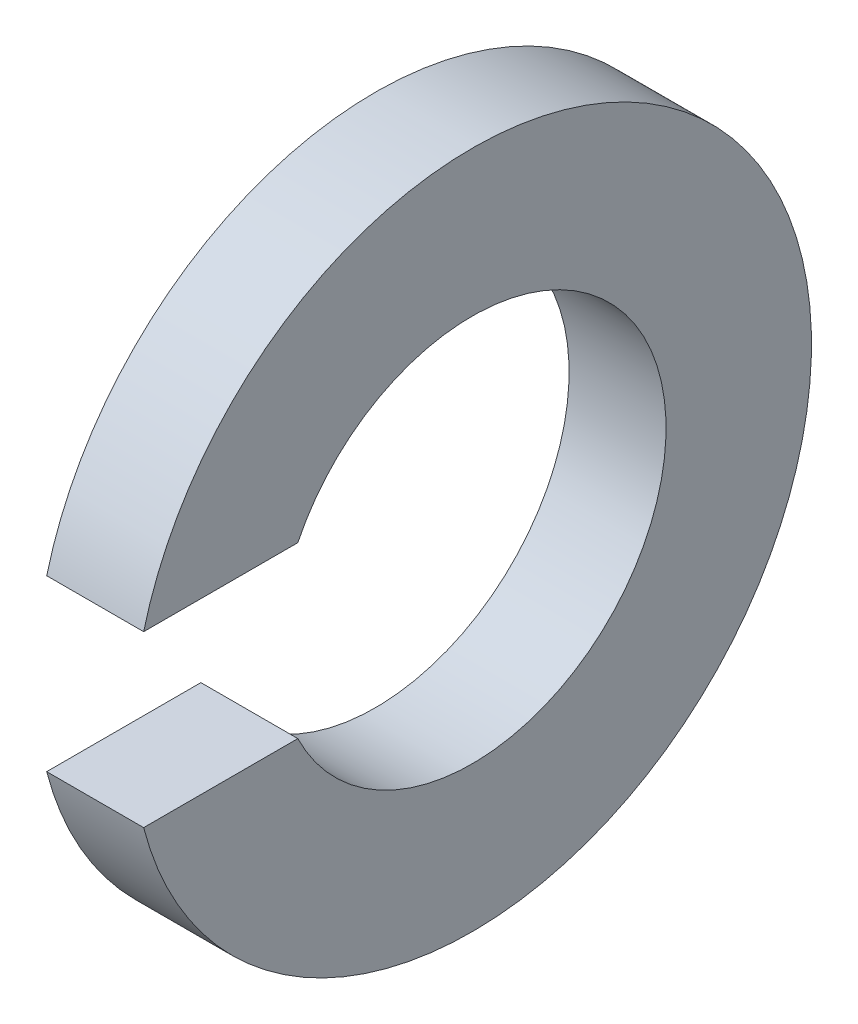
ISO-10303-21;
HEADER;
FILE_DESCRIPTION(('STEP AP214'),'2;1');
FILE_NAME('part.step','',(''),(''),'','','');
FILE_SCHEMA(('AUTOMOTIVE_DESIGN { 1 0 10303 214 1 1 1 1 }'));
ENDSEC;
DATA;
#1=APPLICATION_CONTEXT('core data for automotive mechanical design processes');
#2=APPLICATION_PROTOCOL_DEFINITION('international standard','automotive_design',2000,#1);
#3=PRODUCT_CONTEXT('',#1,'mechanical');
#4=PRODUCT('Part','Part','',(#3));
#5=PRODUCT_RELATED_PRODUCT_CATEGORY('part','',(#4));
#6=PRODUCT_DEFINITION_FORMATION('','',#4);
#7=PRODUCT_DEFINITION_CONTEXT('part definition',#1,'design');
#8=PRODUCT_DEFINITION('design','',#6,#7);
#9=PRODUCT_DEFINITION_SHAPE('','',#8);
#10=(LENGTH_UNIT() NAMED_UNIT(*) SI_UNIT(.MILLI.,.METRE.));
#11=(NAMED_UNIT(*) PLANE_ANGLE_UNIT() SI_UNIT($,.RADIAN.));
#12=(NAMED_UNIT(*) SI_UNIT($,.STERADIAN.) SOLID_ANGLE_UNIT());
#13=UNCERTAINTY_MEASURE_WITH_UNIT(LENGTH_MEASURE(1.E-05),#10,'distance_accuracy_value','');
#14=(GEOMETRIC_REPRESENTATION_CONTEXT(3) GLOBAL_UNCERTAINTY_ASSIGNED_CONTEXT((#13)) GLOBAL_UNIT_ASSIGNED_CONTEXT((#10,
#11,#12)) REPRESENTATION_CONTEXT('',''));
#15=CARTESIAN_POINT('',(0.,0.,0.));
#16=DIRECTION('',(0.,0.,1.));
#17=DIRECTION('',(1.,0.,0.));
#18=AXIS2_PLACEMENT_3D('',#15,#16,#17);
#19=CARTESIAN_POINT('',(0.5,0.,0.));
#20=DIRECTION('',(1.,0.,0.));
#21=DIRECTION('',(0.,0.,1.));
#22=AXIS2_PLACEMENT_3D('',#19,#20,#21);
#23=CYLINDRICAL_SURFACE('',#22,3.5);
#24=DIRECTION('',(1.,0.,0.));
#25=VECTOR('',#24,1.);
#26=CARTESIAN_POINT('',(0.5,-0.875,3.38886042793149));
#27=LINE('',#26,#25);
#28=CARTESIAN_POINT('',(-0.5,-0.875,3.38886042793149));
#29=VERTEX_POINT('',#28);
#30=CARTESIAN_POINT('',(0.5,-0.875,3.38886042793149));
#31=VERTEX_POINT('',#30);
#32=EDGE_CURVE('E11',#29,#31,#27,.T.);
#33=ORIENTED_EDGE('',*,*,#32,.F.);
#34=CARTESIAN_POINT('',(-0.5,0.,0.));
#35=DIRECTION('',(1.,0.,0.));
#36=DIRECTION('',(0.,0.,-1.));
#37=AXIS2_PLACEMENT_3D('',#34,#35,#36);
#38=CIRCLE('',#37,3.5);
#39=CARTESIAN_POINT('',(-0.5,0.875,3.38886042793149));
#40=VERTEX_POINT('',#39);
#41=EDGE_CURVE('E25',#29,#40,#38,.T.);
#42=ORIENTED_EDGE('',*,*,#41,.T.);
#43=DIRECTION('',(-1.,0.,0.));
#44=VECTOR('',#43,1.);
#45=CARTESIAN_POINT('',(0.5,0.875,3.38886042793149));
#46=LINE('',#45,#44);
#47=CARTESIAN_POINT('',(0.5,0.875,3.38886042793149));
#48=VERTEX_POINT('',#47);
#49=EDGE_CURVE('E68',#48,#40,#46,.T.);
#50=ORIENTED_EDGE('',*,*,#49,.F.);
#51=CARTESIAN_POINT('',(0.5,0.,0.));
#52=DIRECTION('',(1.,0.,0.));
#53=DIRECTION('',(0.,0.,-1.));
#54=AXIS2_PLACEMENT_3D('',#51,#52,#53);
#55=CIRCLE('',#54,3.5);
#56=EDGE_CURVE('E92',#31,#48,#55,.T.);
#57=ORIENTED_EDGE('',*,*,#56,.F.);
#58=EDGE_LOOP('',(#33,#42,#50,#57));
#59=FACE_BOUND('',#58,.T.);
#60=ADVANCED_FACE('F17',(#59),#23,.T.);
#61=CARTESIAN_POINT('',(0.5,3.5,0.));
#62=DIRECTION('',(-1.,0.,0.));
#63=DIRECTION('',(0.,0.,1.));
#64=AXIS2_PLACEMENT_3D('',#61,#62,#63);
#65=PLANE('',#64);
#66=DIRECTION('',(0.,0.,-1.));
#67=VECTOR('',#66,1.);
#68=CARTESIAN_POINT('',(0.5,-0.875,0.));
#69=LINE('',#68,#67);
#70=CARTESIAN_POINT('',(0.5,-0.875,1.7984368212423));
#71=VERTEX_POINT('',#70);
#72=EDGE_CURVE('E87',#31,#71,#69,.T.);
#73=ORIENTED_EDGE('',*,*,#72,.F.);
#74=ORIENTED_EDGE('',*,*,#56,.T.);
#75=DIRECTION('',(0.,0.,1.));
#76=VECTOR('',#75,1.);
#77=CARTESIAN_POINT('',(0.5,0.875,0.));
#78=LINE('',#77,#76);
#79=CARTESIAN_POINT('',(0.5,0.875,1.7984368212423));
#80=VERTEX_POINT('',#79);
#81=EDGE_CURVE('E76',#80,#48,#78,.T.);
#82=ORIENTED_EDGE('',*,*,#81,.F.);
#83=CARTESIAN_POINT('',(0.5,0.,0.));
#84=DIRECTION('',(1.,0.,0.));
#85=DIRECTION('',(0.,0.,1.));
#86=AXIS2_PLACEMENT_3D('',#83,#84,#85);
#87=CIRCLE('',#86,2.);
#88=EDGE_CURVE('E60',#71,#80,#87,.T.);
#89=ORIENTED_EDGE('',*,*,#88,.F.);
#90=EDGE_LOOP('',(#73,#74,#82,#89));
#91=FACE_BOUND('',#90,.T.);
#92=ADVANCED_FACE('F106',(#91),#65,.F.);
#93=CARTESIAN_POINT('',(7.,0.,0.));
#94=DIRECTION('',(-1.,0.,0.));
#95=DIRECTION('',(0.,0.,1.));
#96=AXIS2_PLACEMENT_3D('',#93,#94,#95);
#97=CYLINDRICAL_SURFACE('',#96,2.);
#98=CARTESIAN_POINT('',(-0.5,0.,0.));
#99=DIRECTION('',(-1.,0.,0.));
#100=DIRECTION('',(0.,0.,-1.));
#101=AXIS2_PLACEMENT_3D('',#98,#99,#100);
#102=CIRCLE('',#101,2.);
#103=CARTESIAN_POINT('',(-0.5,0.875,1.7984368212423));
#104=VERTEX_POINT('',#103);
#105=CARTESIAN_POINT('',(-0.5,-0.875,1.7984368212423));
#106=VERTEX_POINT('',#105);
#107=EDGE_CURVE('E58',#104,#106,#102,.T.);
#108=ORIENTED_EDGE('',*,*,#107,.T.);
#109=DIRECTION('',(-1.,0.,0.));
#110=VECTOR('',#109,1.);
#111=CARTESIAN_POINT('',(7.,-0.875,1.7984368212423));
#112=LINE('',#111,#110);
#113=EDGE_CURVE('E63',#71,#106,#112,.T.);
#114=ORIENTED_EDGE('',*,*,#113,.F.);
#115=ORIENTED_EDGE('',*,*,#88,.T.);
#116=DIRECTION('',(-1.,0.,0.));
#117=VECTOR('',#116,1.);
#118=CARTESIAN_POINT('',(7.,0.875,1.7984368212423));
#119=LINE('',#118,#117);
#120=EDGE_CURVE('E53',#80,#104,#119,.T.);
#121=ORIENTED_EDGE('',*,*,#120,.T.);
#122=EDGE_LOOP('',(#108,#114,#115,#121));
#123=FACE_BOUND('',#122,.T.);
#124=ADVANCED_FACE('F55',(#123),#97,.F.);
#125=CARTESIAN_POINT('',(7.,0.875,1.7984368212423));
#126=DIRECTION('',(0.,-1.,0.));
#127=DIRECTION('',(0.,0.,-1.));
#128=AXIS2_PLACEMENT_3D('',#125,#126,#127);
#129=PLANE('',#128);
#130=DIRECTION('',(0.,0.,-1.));
#131=VECTOR('',#130,1.);
#132=CARTESIAN_POINT('',(-0.5,0.875,0.));
#133=LINE('',#132,#131);
#134=EDGE_CURVE('E64',#40,#104,#133,.T.);
#135=ORIENTED_EDGE('',*,*,#134,.T.);
#136=ORIENTED_EDGE('',*,*,#120,.F.);
#137=ORIENTED_EDGE('',*,*,#81,.T.);
#138=ORIENTED_EDGE('',*,*,#49,.T.);
#139=EDGE_LOOP('',(#135,#136,#137,#138));
#140=FACE_BOUND('',#139,.T.);
#141=ADVANCED_FACE('F67',(#140),#129,.T.);
#142=CARTESIAN_POINT('',(-0.5,0.,0.));
#143=DIRECTION('',(1.,0.,0.));
#144=DIRECTION('',(0.,0.,-1.));
#145=AXIS2_PLACEMENT_3D('',#142,#143,#144);
#146=PLANE('',#145);
#147=DIRECTION('',(0.,0.,1.));
#148=VECTOR('',#147,1.);
#149=CARTESIAN_POINT('',(-0.5,-0.875,0.));
#150=LINE('',#149,#148);
#151=EDGE_CURVE('E70',#106,#29,#150,.T.);
#152=ORIENTED_EDGE('',*,*,#151,.F.);
#153=ORIENTED_EDGE('',*,*,#107,.F.);
#154=ORIENTED_EDGE('',*,*,#134,.F.);
#155=ORIENTED_EDGE('',*,*,#41,.F.);
#156=EDGE_LOOP('',(#152,#153,#154,#155));
#157=FACE_BOUND('',#156,.T.);
#158=ADVANCED_FACE('F72',(#157),#146,.F.);
#159=CARTESIAN_POINT('',(7.,-0.875,3.5));
#160=DIRECTION('',(0.,1.,0.));
#161=DIRECTION('',(0.,0.,1.));
#162=AXIS2_PLACEMENT_3D('',#159,#160,#161);
#163=PLANE('',#162);
#164=ORIENTED_EDGE('',*,*,#151,.T.);
#165=ORIENTED_EDGE('',*,*,#32,.T.);
#166=ORIENTED_EDGE('',*,*,#72,.T.);
#167=ORIENTED_EDGE('',*,*,#113,.T.);
#168=EDGE_LOOP('',(#164,#165,#166,#167));
#169=FACE_BOUND('',#168,.T.);
#170=ADVANCED_FACE('F121',(#169),#163,.T.);
#171=CLOSED_SHELL('',(#60,#92,#124,#141,#158,#170));
#172=MANIFOLD_SOLID_BREP('B1',#171);
#173=ADVANCED_BREP_SHAPE_REPRESENTATION('',(#18,#172),#14);
#174=SHAPE_DEFINITION_REPRESENTATION(#9,#173);
ENDSEC;
END-ISO-10303-21;
